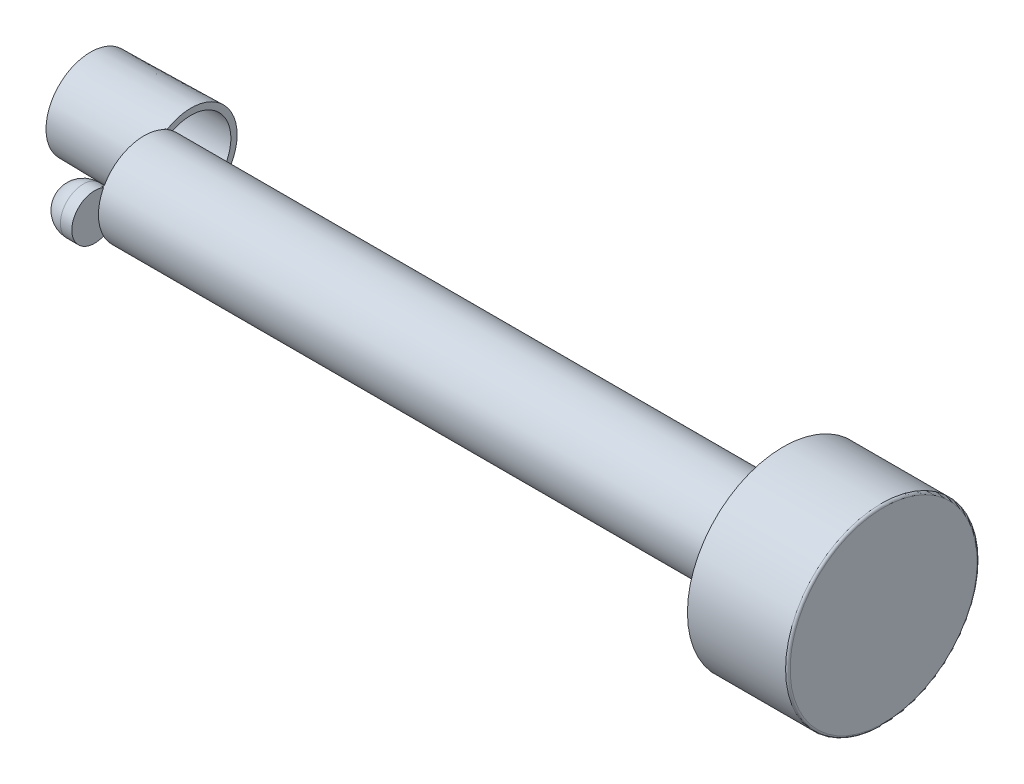
ISO-10303-21;
HEADER;
FILE_DESCRIPTION(('STEP AP214'),'2;1');
FILE_NAME('part.step','',(''),(''),'','','');
FILE_SCHEMA(('AUTOMOTIVE_DESIGN { 1 0 10303 214 1 1 1 1 }'));
ENDSEC;
DATA;
#1=APPLICATION_CONTEXT('core data for automotive mechanical design processes');
#2=APPLICATION_PROTOCOL_DEFINITION('international standard','automotive_design',2000,#1);
#3=PRODUCT_CONTEXT('',#1,'mechanical');
#4=PRODUCT('Part','Part','',(#3));
#5=PRODUCT_RELATED_PRODUCT_CATEGORY('part','',(#4));
#6=PRODUCT_DEFINITION_FORMATION('','',#4);
#7=PRODUCT_DEFINITION_CONTEXT('part definition',#1,'design');
#8=PRODUCT_DEFINITION('design','',#6,#7);
#9=PRODUCT_DEFINITION_SHAPE('','',#8);
#10=(LENGTH_UNIT() NAMED_UNIT(*) SI_UNIT(.MILLI.,.METRE.));
#11=(NAMED_UNIT(*) PLANE_ANGLE_UNIT() SI_UNIT($,.RADIAN.));
#12=(NAMED_UNIT(*) SI_UNIT($,.STERADIAN.) SOLID_ANGLE_UNIT());
#13=UNCERTAINTY_MEASURE_WITH_UNIT(LENGTH_MEASURE(1.E-05),#10,'distance_accuracy_value','');
#14=(GEOMETRIC_REPRESENTATION_CONTEXT(3) GLOBAL_UNCERTAINTY_ASSIGNED_CONTEXT((#13)) GLOBAL_UNIT_ASSIGNED_CONTEXT((#10,
#11,#12)) REPRESENTATION_CONTEXT('',''));
#15=CARTESIAN_POINT('',(0.,0.,0.));
#16=DIRECTION('',(0.,0.,1.));
#17=DIRECTION('',(1.,0.,0.));
#18=AXIS2_PLACEMENT_3D('',#15,#16,#17);
#19=CARTESIAN_POINT('',(0.,0.,0.));
#20=DIRECTION('',(1.,0.,0.));
#21=DIRECTION('',(0.,0.,-1.));
#22=AXIS2_PLACEMENT_3D('',#19,#20,#21);
#23=PLANE('',#22);
#24=CARTESIAN_POINT('',(0.,0.,0.));
#25=DIRECTION('',(1.,0.,0.));
#26=DIRECTION('',(0.,0.,-1.));
#27=AXIS2_PLACEMENT_3D('',#24,#25,#26);
#28=CIRCLE('',#27,4.);
#29=CARTESIAN_POINT('',(0.,-3.1166265568057,-2.50731707317073));
#30=VERTEX_POINT('',#29);
#31=CARTESIAN_POINT('',(0.,3.1166265568057,-2.50731707317073));
#32=VERTEX_POINT('',#31);
#33=EDGE_CURVE('E114',#30,#32,#28,.T.);
#34=ORIENTED_EDGE('',*,*,#33,.F.);
#35=CARTESIAN_POINT('',(0.,0.,-4.1));
#36=DIRECTION('',(-1.,0.,0.));
#37=DIRECTION('',(0.,0.,1.));
#38=AXIS2_PLACEMENT_3D('',#35,#36,#37);
#39=CIRCLE('',#38,3.5);
#40=EDGE_CURVE('E121',#30,#32,#39,.T.);
#41=ORIENTED_EDGE('',*,*,#40,.T.);
#42=EDGE_LOOP('',(#34,#41));
#43=FACE_BOUND('',#42,.T.);
#44=ADVANCED_FACE('F33',(#43),#23,.F.);
#45=CARTESIAN_POINT('',(1.,0.,0.));
#46=DIRECTION('',(-1.,0.,0.));
#47=DIRECTION('',(0.,0.,1.));
#48=AXIS2_PLACEMENT_3D('',#45,#46,#47);
#49=CYLINDRICAL_SURFACE('',#48,4.);
#50=CARTESIAN_POINT('',(0.,3.4635733898474,-2.00091463414634));
#51=VERTEX_POINT('',#50);
#52=EDGE_CURVE('E135',#32,#51,#28,.T.);
#53=ORIENTED_EDGE('',*,*,#52,.T.);
#54=CARTESIAN_POINT('',(-0.196509518712543,3.46161460532734,-2.00430145541606));
#55=CARTESIAN_POINT('',(-0.163757930433236,3.46194129952575,-2.00373722430909));
#56=CARTESIAN_POINT('',(-0.131006343067538,3.46226787866832,-2.00317287364976));
#57=CARTESIAN_POINT('',(-0.0655031701633607,3.46292080684177,-2.00204393322638));
#58=CARTESIAN_POINT('',(-0.0327515846248809,3.46324715587265,-2.00147934346233));
#59=CARTESIAN_POINT('',(0.,3.46357338984769,-2.00091463414592));
#60=B_SPLINE_CURVE_WITH_KNOTS('',3,(#54,#55,#56,#57,#58,#59),.UNSPECIFIED.,.F.,.F.,(4,2,4),(0.,
0.0982742315420674,0.196548463084135),.UNSPECIFIED.);
#61=CARTESIAN_POINT('',(-0.196509518712543,3.46161460532734,-2.00430145541606));
#62=VERTEX_POINT('',#61);
#63=EDGE_CURVE('E173',#62,#51,#60,.T.);
#64=ORIENTED_EDGE('',*,*,#63,.F.);
#65=CARTESIAN_POINT('',(-0.196509518712543,3.46161460532734,-2.00430145541606));
#66=CARTESIAN_POINT('',(-0.186228413976424,3.46170890980057,-2.00413635354212));
#67=CARTESIAN_POINT('',(-0.175977058727814,3.46227208304456,-2.00316591494196));
#68=CARTESIAN_POINT('',(-0.155858499034461,3.46426383597185,-1.99972056421048));
#69=CARTESIAN_POINT('',(-0.14598990241535,3.4656888884805,-1.99725178378498));
#70=CARTESIAN_POINT('',(-0.126880843730687,3.46933252468751,-1.99091546448274));
#71=CARTESIAN_POINT('',(-0.117639894229995,3.47155048402618,-1.98704902613902));
#72=CARTESIAN_POINT('',(-0.0999848206849864,3.47667213872164,-1.97807422393648));
#73=CARTESIAN_POINT('',(-0.091571339244297,3.47957636116068,-1.97296490539812));
#74=CARTESIAN_POINT('',(-0.0753474839671066,3.48610493411844,-1.96140723938538));
#75=CARTESIAN_POINT('',(-0.067586484024916,3.48975748182476,-1.95490577031648));
#76=CARTESIAN_POINT('',(-0.0532673461235203,3.49754244618214,-1.94094326630355));
#77=CARTESIAN_POINT('',(-0.0467094498074463,3.50167495896248,-1.93348203910309));
#78=CARTESIAN_POINT('',(-0.0341593344331263,3.51079864833767,-1.91687053747935));
#79=CARTESIAN_POINT('',(-0.0283254110505752,3.51583359321851,-1.90762485363682));
#80=CARTESIAN_POINT('',(-0.0182755696739683,3.52618179136174,-1.88842827088881));
#81=CARTESIAN_POINT('',(-0.0140614119060524,3.5314953403044,-1.8784766186242));
#82=CARTESIAN_POINT('',(-0.00709580656185521,3.5425240194525,-1.85759756736367));
#83=CARTESIAN_POINT('',(-0.00442733990265859,3.54824599169842,-1.84664625438155));
#84=CARTESIAN_POINT('',(-0.00088098036703332,3.55969014669868,-1.82449033188031));
#85=CARTESIAN_POINT('',(1.20114942700425E-06,3.56541229588589,-1.81328639449385));
#86=CARTESIAN_POINT('',(0.,3.57107477707088,-1.80206130211161));
#87=B_SPLINE_CURVE_WITH_KNOTS('',3,(#65,#66,#67,#68,#69,#70,#71,#72,#73,#74,#75,#76,#77,#78,#79,
#80,#81,#82,#83,#84,#85,#86),.UNSPECIFIED.,.F.,.F.,(4,2,2,2,2,2,2,2,2,2,4),(0.,
0.0307902288591626,0.0614552957399035,0.0920962689801449,0.122760852858493,0.154919844712333,
0.187085288638908,0.223049809332817,0.259053303505371,0.296843776707732,0.334543411767175),.UNSPECIFIED.);
#88=CARTESIAN_POINT('',(0.,3.57107477707088,-1.80206130211161));
#89=VERTEX_POINT('',#88);
#90=EDGE_CURVE('E46',#62,#89,#87,.T.);
#91=ORIENTED_EDGE('',*,*,#90,.T.);
#92=CARTESIAN_POINT('',(0.,2.01603826872064,3.45479228016011));
#93=VERTEX_POINT('',#92);
#94=EDGE_CURVE('E111',#89,#93,#28,.T.);
#95=ORIENTED_EDGE('',*,*,#94,.T.);
#96=CARTESIAN_POINT('',(0.,2.01603826872064,3.45479228016011));
#97=CARTESIAN_POINT('',(9.49307193796602E-06,2.00624438563196,3.46050963885048));
#98=CARTESIAN_POINT('',(-0.000951005305651288,1.99642591984421,3.46618125477343));
#99=CARTESIAN_POINT('',(-0.00474768782230124,1.97702474123825,3.47728256733756));
#100=CARTESIAN_POINT('',(-0.00758281998979137,1.9674418993234,3.48271239783638));
#101=CARTESIAN_POINT('',(-0.0150669368735395,1.94877946214422,3.49318971224865));
#102=CARTESIAN_POINT('',(-0.0197170513179024,1.93970018434914,3.4982369556811));
#103=CARTESIAN_POINT('',(-0.0306995682128399,1.92232408775959,3.50781532235016));
#104=CARTESIAN_POINT('',(-0.0370315347536729,1.91402706697029,3.51234657888833));
#105=CARTESIAN_POINT('',(-0.0511723963013751,1.89849659547287,3.52076534420059));
#106=CARTESIAN_POINT('',(-0.0589751206692201,1.89125891787573,3.52465541965818));
#107=CARTESIAN_POINT('',(-0.0758561148090955,1.87802603759496,3.53172402907698));
#108=CARTESIAN_POINT('',(-0.0849346357789641,1.87203108017332,3.53490242259127));
#109=CARTESIAN_POINT('',(-0.104068021247834,1.86149135103254,3.54046401704401));
#110=CARTESIAN_POINT('',(-0.114118905219684,1.85694096828244,3.54285029641067));
#111=CARTESIAN_POINT('',(-0.134939735078802,1.84940016911909,3.54679252782362));
#112=CARTESIAN_POINT('',(-0.145709227074704,1.84640877833267,3.54834899851603));
#113=CARTESIAN_POINT('',(-0.163789672643096,1.84283794205747,3.55020433266981));
#114=CARTESIAN_POINT('',(-0.170985127423814,1.8417802473485,3.55075296262703));
#115=CARTESIAN_POINT('',(-0.185452698724941,1.8403690878274,3.55148445086093));
#116=CARTESIAN_POINT('',(-0.192724690639011,1.84001461621119,3.55166783206553));
#117=CARTESIAN_POINT('',(-0.200000000000245,1.84001549171848,3.55166763510375));
#118=B_SPLINE_CURVE_WITH_KNOTS('',3,(#96,#97,#98,#99,#100,#101,#102,#103,#104,#105,#106,#107,
#108,#109,#110,#111,#112,#113,#114,#115,#116,#117),.UNSPECIFIED.,.F.,.F.,(4,2,2,2,2,2,2,2,2,2,
4),(0.,0.0339784265399295,0.0679378018722003,0.101918348871641,0.135890097224661,
0.169722366052867,0.203561305639758,0.237267152251013,0.270951907298916,0.292791721269298,
0.314600244561022),.UNSPECIFIED.);
#119=CARTESIAN_POINT('',(-0.2,1.84001549171707,3.55166763510343));
#120=VERTEX_POINT('',#119);
#121=EDGE_CURVE('E183',#93,#120,#118,.T.);
#122=ORIENTED_EDGE('',*,*,#121,.T.);
#123=DIRECTION('',(1.,0.,0.));
#124=VECTOR('',#123,1.);
#125=CARTESIAN_POINT('',(0.,1.84001549171707,3.55166763510343));
#126=LINE('',#125,#124);
#127=CARTESIAN_POINT('',(0.,1.84001549171707,3.55166763510343));
#128=VERTEX_POINT('',#127);
#129=EDGE_CURVE('E59',#128,#120,#126,.F.);
#130=ORIENTED_EDGE('',*,*,#129,.F.);
#131=CARTESIAN_POINT('',(0.,-1.84001549171707,3.55166763510343));
#132=VERTEX_POINT('',#131);
#133=EDGE_CURVE('E106',#128,#132,#28,.T.);
#134=ORIENTED_EDGE('',*,*,#133,.T.);
#135=DIRECTION('',(1.,0.,0.));
#136=VECTOR('',#135,1.);
#137=CARTESIAN_POINT('',(-0.2,-1.84001549171707,3.55166763510343));
#138=LINE('',#137,#136);
#139=CARTESIAN_POINT('',(-0.2,-1.84001549171707,3.55166763510343));
#140=VERTEX_POINT('',#139);
#141=EDGE_CURVE('E97',#140,#132,#138,.T.);
#142=ORIENTED_EDGE('',*,*,#141,.F.);
#143=CARTESIAN_POINT('',(-0.2,-1.84001549171707,3.55166763510343));
#144=CARTESIAN_POINT('',(-0.188775567708883,-1.84000632918303,3.5516708668143));
#145=CARTESIAN_POINT('',(-0.177554079053319,-1.84085634903461,3.55123198716677));
#146=CARTESIAN_POINT('',(-0.155437874670008,-1.84420706995971,3.54949386383636));
#147=CARTESIAN_POINT('',(-0.144542893922371,-1.84670639218398,3.54819533883102));
#148=CARTESIAN_POINT('',(-0.123375855772317,-1.85328978135263,3.54476090768498));
#149=CARTESIAN_POINT('',(-0.113104092246463,-1.85737458931558,3.54262460998428));
#150=CARTESIAN_POINT('',(-0.0934810360737707,-1.8669999233081,3.53756143927729));
#151=CARTESIAN_POINT('',(-0.0841295919611501,-1.87254020924312,3.53463469665997));
#152=CARTESIAN_POINT('',(-0.0666023881086761,-1.88491316665724,3.52805205327164));
#153=CARTESIAN_POINT('',(-0.0584275003199356,-1.89174678803873,3.52439561646171));
#154=CARTESIAN_POINT('',(-0.0434889751127516,-1.90649831451892,3.51643772490171));
#155=CARTESIAN_POINT('',(-0.036725598373969,-1.914416419455,3.5121361512586));
#156=CARTESIAN_POINT('',(-0.0247825512468713,-1.93112123702236,3.50297896773827));
#157=CARTESIAN_POINT('',(-0.0196072778522562,-1.93991027368614,3.49812186985065));
#158=CARTESIAN_POINT('',(-0.0110078974046918,-1.95807849926832,3.48798459416151));
#159=CARTESIAN_POINT('',(-0.00758294395250916,-1.967457400478,3.48270462228));
#160=CARTESIAN_POINT('',(-0.00338933206266107,-1.98341546132085,3.47363179260552));
#161=CARTESIAN_POINT('',(-0.00211872494404291,-1.98991068750471,3.46991520921776));
#162=CARTESIAN_POINT('',(-0.000424156854156729,-2.00295291410741,3.46240332481476));
#163=CARTESIAN_POINT('',(1.04129912460666E-06,-2.00949982477271,3.45860814705201));
#164=CARTESIAN_POINT('',(1.00765429915983E-12,-2.01603826872046,3.45479228016027));
#165=B_SPLINE_CURVE_WITH_KNOTS('',3,(#143,#144,#145,#146,#147,#148,#149,#150,#151,#152,#153,
#154,#155,#156,#157,#158,#159,#160,#161,#162,#163,#164),.UNSPECIFIED.,.F.,.F.,(4,2,2,2,2,2,2,2,
2,2,4),(0.,0.0336283682487797,0.0672286580766538,0.100844670832817,0.134455141795094,
0.168090394759991,0.201731854040098,0.235465633338153,0.269183084577829,0.291909693341325,
0.314603019151342),.UNSPECIFIED.);
#166=CARTESIAN_POINT('',(0.,-2.01603826872064,3.45479228016011));
#167=VERTEX_POINT('',#166);
#168=EDGE_CURVE('E178',#140,#167,#165,.T.);
#169=ORIENTED_EDGE('',*,*,#168,.T.);
#170=CARTESIAN_POINT('',(0.,-3.57107477707088,-1.80206130211161));
#171=VERTEX_POINT('',#170);
#172=EDGE_CURVE('E112',#167,#171,#28,.T.);
#173=ORIENTED_EDGE('',*,*,#172,.T.);
#174=CARTESIAN_POINT('',(0.,-3.57107477707088,-1.80206130211161));
#175=CARTESIAN_POINT('',(8.25288774161548E-06,-3.56341210447424,-1.81726018618969));
#176=CARTESIAN_POINT('',(-0.00161522542768494,-3.55562491057541,-1.83243694789484));
#177=CARTESIAN_POINT('',(-0.00815460849651412,-3.54011329532851,-1.86222124343084));
#178=CARTESIAN_POINT('',(-0.0130916040286348,-3.53238959895128,-1.87682449254198));
#179=CARTESIAN_POINT('',(-0.0253383764586932,-3.51850091594059,-1.90271872572988));
#180=CARTESIAN_POINT('',(-0.0322046986531956,-3.51227152869539,-1.91418400378387));
#181=CARTESIAN_POINT('',(-0.0482956424143895,-3.50047337678014,-1.93567429213193));
#182=CARTESIAN_POINT('',(-0.0575127219552882,-3.49490258125452,-1.94570375127717));
#183=CARTESIAN_POINT('',(-0.0768998896124404,-3.48534741073249,-1.9627628741259));
#184=CARTESIAN_POINT('',(-0.0868260743885053,-3.48125314202644,-1.97000748091226));
#185=CARTESIAN_POINT('',(-0.10811898934221,-3.47407411973142,-1.98264007477368));
#186=CARTESIAN_POINT('',(-0.119483745498682,-3.4709880031422,-1.98803056909585));
#187=CARTESIAN_POINT('',(-0.141649945935426,-3.46638502101654,-1.99604468379762));
#188=CARTESIAN_POINT('',(-0.152319496102444,-3.46471231126749,-1.99894401769115));
#189=CARTESIAN_POINT('',(-0.174147126869764,-3.46237506931144,-2.00298806441265));
#190=CARTESIAN_POINT('',(-0.185307419668214,-3.46171571747898,-2.00412376168114));
#191=CARTESIAN_POINT('',(-0.1965095187125,-3.46161460532745,-2.00430145541624));
#192=B_SPLINE_CURVE_WITH_KNOTS('',3,(#174,#175,#176,#177,#178,#179,#180,#181,#182,#183,#184,
#185,#186,#187,#188,#189,#190,#191),.UNSPECIFIED.,.F.,.F.,(4,2,2,2,2,2,2,2,4),(0.,
0.0510486867167465,0.10242542299057,0.146412025726984,0.190259241885509,0.228889025924215,
0.267466365062532,0.300823177353368,0.334349951974751),.UNSPECIFIED.);
#193=CARTESIAN_POINT('',(-0.196509518712543,-3.46161460532734,-2.00430145541606));
#194=VERTEX_POINT('',#193);
#195=EDGE_CURVE('E11',#171,#194,#192,.T.);
#196=ORIENTED_EDGE('',*,*,#195,.T.);
#197=CARTESIAN_POINT('',(0.,-3.4635733898474,-2.00091463414634));
#198=CARTESIAN_POINT('',(-0.0327515846248745,-3.46324715587244,-2.00147934346258));
#199=CARTESIAN_POINT('',(-0.0655031701633576,-3.46292080684165,-2.0020439332265));
#200=CARTESIAN_POINT('',(-0.131006343067541,-3.46226787866843,-2.00317287364965));
#201=CARTESIAN_POINT('',(-0.163757930433242,-3.461941299526,-2.0037372243089));
#202=CARTESIAN_POINT('',(-0.196509518712551,-3.46161460532774,-2.00430145541582));
#203=B_SPLINE_CURVE_WITH_KNOTS('',3,(#197,#198,#199,#200,#201,#202),.UNSPECIFIED.,.F.,.F.,(4,2,
4),(0.,0.0982742315420676,0.196548463084135),.UNSPECIFIED.);
#204=CARTESIAN_POINT('',(0.,-3.4635733898474,-2.00091463414634));
#205=VERTEX_POINT('',#204);
#206=EDGE_CURVE('E52',#205,#194,#203,.T.);
#207=ORIENTED_EDGE('',*,*,#206,.F.);
#208=EDGE_CURVE('E137',#205,#30,#28,.T.);
#209=ORIENTED_EDGE('',*,*,#208,.T.);
#210=ORIENTED_EDGE('',*,*,#33,.T.);
#211=EDGE_LOOP('',(#53,#64,#91,#95,#122,#130,#134,#142,#169,#173,#196,#207,#209,#210));
#212=FACE_BOUND('',#211,.T.);
#213=CARTESIAN_POINT('',(56.,0.,0.));
#214=DIRECTION('',(1.,0.,0.));
#215=DIRECTION('',(0.,0.,-1.));
#216=AXIS2_PLACEMENT_3D('',#213,#214,#215);
#217=CIRCLE('',#216,4.);
#218=CARTESIAN_POINT('',(56.,0.,-4.));
#219=VERTEX_POINT('',#218);
#220=EDGE_CURVE('E133',#219,#219,#217,.T.);
#221=ORIENTED_EDGE('',*,*,#220,.F.);
#222=EDGE_LOOP('',(#221));
#223=FACE_BOUND('',#222,.T.);
#224=ADVANCED_FACE('F108',(#212,#223),#49,.T.);
#225=ORIENTED_EDGE('',*,*,#172,.F.);
#226=CARTESIAN_POINT('',(0.,0.,4.33546798611203));
#227=DIRECTION('',(1.,0.,0.));
#228=DIRECTION('',(0.,0.,-1.));
#229=AXIS2_PLACEMENT_3D('',#226,#227,#228);
#230=CIRCLE('',#229,2.2);
#231=EDGE_CURVE('E150',#167,#93,#230,.T.);
#232=ORIENTED_EDGE('',*,*,#231,.T.);
#233=ORIENTED_EDGE('',*,*,#94,.F.);
#234=CARTESIAN_POINT('',(0.,0.,-4.1));
#235=DIRECTION('',(1.,0.,0.));
#236=DIRECTION('',(0.,0.,-1.));
#237=AXIS2_PLACEMENT_3D('',#234,#235,#236);
#238=CIRCLE('',#237,4.24653945262314);
#239=EDGE_CURVE('E104',#89,#171,#238,.T.);
#240=ORIENTED_EDGE('',*,*,#239,.T.);
#241=EDGE_LOOP('',(#225,#232,#233,#240));
#242=FACE_BOUND('',#241,.T.);
#243=ADVANCED_FACE('F206',(#242),#23,.F.);
#244=CARTESIAN_POINT('',(64.8,0.,0.));
#245=DIRECTION('',(-1.,0.,0.));
#246=DIRECTION('',(0.,0.,1.));
#247=AXIS2_PLACEMENT_3D('',#244,#245,#246);
#248=CYLINDRICAL_SURFACE('',#247,8.39);
#249=CARTESIAN_POINT('',(64.6,0.,0.));
#250=DIRECTION('',(1.,0.,0.));
#251=DIRECTION('',(0.,0.,-1.));
#252=AXIS2_PLACEMENT_3D('',#249,#250,#251);
#253=CIRCLE('',#252,8.39);
#254=CARTESIAN_POINT('',(64.6,0.,-8.39));
#255=VERTEX_POINT('',#254);
#256=EDGE_CURVE('E144',#255,#255,#253,.F.);
#257=ORIENTED_EDGE('',*,*,#256,.T.);
#258=EDGE_LOOP('',(#257));
#259=FACE_BOUND('',#258,.T.);
#260=CARTESIAN_POINT('',(56.,0.,0.));
#261=DIRECTION('',(1.,0.,0.));
#262=DIRECTION('',(0.,0.,-1.));
#263=AXIS2_PLACEMENT_3D('',#260,#261,#262);
#264=CIRCLE('',#263,8.39);
#265=CARTESIAN_POINT('',(56.,0.,-8.39));
#266=VERTEX_POINT('',#265);
#267=EDGE_CURVE('E128',#266,#266,#264,.T.);
#268=ORIENTED_EDGE('',*,*,#267,.T.);
#269=EDGE_LOOP('',(#268));
#270=FACE_BOUND('',#269,.T.);
#271=ADVANCED_FACE('F213',(#259,#270),#248,.T.);
#272=CARTESIAN_POINT('',(64.8,0.,0.));
#273=DIRECTION('',(1.,0.,0.));
#274=DIRECTION('',(0.,0.,-1.));
#275=AXIS2_PLACEMENT_3D('',#272,#273,#274);
#276=PLANE('',#275);
#277=CARTESIAN_POINT('',(64.8,0.,0.));
#278=DIRECTION('',(1.,0.,0.));
#279=DIRECTION('',(0.,0.,-1.));
#280=AXIS2_PLACEMENT_3D('',#277,#278,#279);
#281=CIRCLE('',#280,8.19);
#282=CARTESIAN_POINT('',(64.8,0.,-8.19));
#283=VERTEX_POINT('',#282);
#284=EDGE_CURVE('E141',#283,#283,#281,.T.);
#285=ORIENTED_EDGE('',*,*,#284,.T.);
#286=EDGE_LOOP('',(#285));
#287=FACE_BOUND('',#286,.T.);
#288=ADVANCED_FACE('F218',(#287),#276,.T.);
#289=CARTESIAN_POINT('',(56.,0.,0.));
#290=DIRECTION('',(1.,0.,0.));
#291=DIRECTION('',(0.,0.,-1.));
#292=AXIS2_PLACEMENT_3D('',#289,#290,#291);
#293=PLANE('',#292);
#294=ORIENTED_EDGE('',*,*,#220,.T.);
#295=EDGE_LOOP('',(#294));
#296=FACE_BOUND('',#295,.T.);
#297=ORIENTED_EDGE('',*,*,#267,.F.);
#298=EDGE_LOOP('',(#297));
#299=FACE_BOUND('',#298,.T.);
#300=ADVANCED_FACE('F254',(#296,#299),#293,.F.);
#301=CARTESIAN_POINT('',(-8.8,0.,-4.1));
#302=DIRECTION('',(-1.,0.,0.));
#303=DIRECTION('',(0.,0.,1.));
#304=AXIS2_PLACEMENT_3D('',#301,#302,#303);
#305=PLANE('',#304);
#306=CARTESIAN_POINT('',(-8.8,0.,-4.1));
#307=DIRECTION('',(-1.,0.,0.));
#308=DIRECTION('',(0.,0.,1.));
#309=AXIS2_PLACEMENT_3D('',#306,#307,#308);
#310=CIRCLE('',#309,3.89639542863168);
#311=CARTESIAN_POINT('',(-8.8,0.,-0.203604571368314));
#312=VERTEX_POINT('',#311);
#313=EDGE_CURVE('E125',#312,#312,#310,.T.);
#314=ORIENTED_EDGE('',*,*,#313,.T.);
#315=EDGE_LOOP('',(#314));
#316=FACE_BOUND('',#315,.T.);
#317=CARTESIAN_POINT('',(-8.8,0.,-4.1));
#318=DIRECTION('',(-1.,0.,0.));
#319=DIRECTION('',(0.,0.,1.));
#320=AXIS2_PLACEMENT_3D('',#317,#318,#319);
#321=CIRCLE('',#320,3.65360457136831);
#322=CARTESIAN_POINT('',(-8.8,0.,-0.446395428631684));
#323=VERTEX_POINT('',#322);
#324=EDGE_CURVE('E119',#323,#323,#321,.T.);
#325=ORIENTED_EDGE('',*,*,#324,.F.);
#326=EDGE_LOOP('',(#325));
#327=FACE_BOUND('',#326,.T.);
#328=ADVANCED_FACE('F252',(#316,#327),#305,.T.);
#329=CARTESIAN_POINT('',(0.,0.,-4.1));
#330=DIRECTION('',(-1.,0.,0.));
#331=DIRECTION('',(0.,0.,1.));
#332=AXIS2_PLACEMENT_3D('',#329,#330,#331);
#333=PLANE('',#332);
#334=ORIENTED_EDGE('',*,*,#52,.F.);
#335=EDGE_CURVE('E116',#32,#30,#39,.T.);
#336=ORIENTED_EDGE('',*,*,#335,.T.);
#337=ORIENTED_EDGE('',*,*,#208,.F.);
#338=CARTESIAN_POINT('',(0.,0.,-4.1));
#339=DIRECTION('',(-1.,0.,0.));
#340=DIRECTION('',(0.,0.,1.));
#341=AXIS2_PLACEMENT_3D('',#338,#339,#340);
#342=CIRCLE('',#341,4.05);
#343=EDGE_CURVE('E123',#51,#205,#342,.T.);
#344=ORIENTED_EDGE('',*,*,#343,.F.);
#345=EDGE_LOOP('',(#334,#336,#337,#344));
#346=FACE_BOUND('',#345,.T.);
#347=ADVANCED_FACE('F168',(#346),#333,.F.);
#348=CARTESIAN_POINT('',(0.,0.,-4.1));
#349=DIRECTION('',(1.,0.,0.));
#350=DIRECTION('',(0.,0.,1.));
#351=AXIS2_PLACEMENT_3D('',#348,#349,#350);
#352=CONICAL_SURFACE('',#351,4.05,0.0174532925199433);
#353=ORIENTED_EDGE('',*,*,#313,.F.);
#354=EDGE_LOOP('',(#353));
#355=FACE_BOUND('',#354,.T.);
#356=CARTESIAN_POINT('',(-0.196509518712543,0.,-4.1));
#357=DIRECTION('',(1.,0.,0.));
#358=DIRECTION('',(0.,0.,-1.));
#359=AXIS2_PLACEMENT_3D('',#356,#357,#358);
#360=CIRCLE('',#359,4.04656991359186);
#361=EDGE_CURVE('E157',#194,#62,#360,.F.);
#362=ORIENTED_EDGE('',*,*,#361,.T.);
#363=ORIENTED_EDGE('',*,*,#63,.T.);
#364=ORIENTED_EDGE('',*,*,#343,.T.);
#365=ORIENTED_EDGE('',*,*,#206,.T.);
#366=EDGE_LOOP('',(#362,#363,#364,#365));
#367=FACE_BOUND('',#366,.T.);
#368=ADVANCED_FACE('F162',(#355,#367),#352,.T.);
#369=CARTESIAN_POINT('',(0.,0.,-4.1));
#370=DIRECTION('',(-1.,0.,0.));
#371=DIRECTION('',(0.,0.,1.));
#372=AXIS2_PLACEMENT_3D('',#369,#370,#371);
#373=CONICAL_SURFACE('',#372,3.5,0.0174532925199433);
#374=ORIENTED_EDGE('',*,*,#324,.T.);
#375=EDGE_LOOP('',(#374));
#376=FACE_BOUND('',#375,.T.);
#377=ORIENTED_EDGE('',*,*,#335,.F.);
#378=ORIENTED_EDGE('',*,*,#40,.F.);
#379=EDGE_LOOP('',(#377,#378));
#380=FACE_BOUND('',#379,.T.);
#381=ADVANCED_FACE('F167',(#376,#380),#373,.F.);
#382=CARTESIAN_POINT('',(-3.,0.,4.33546798611203));
#383=DIRECTION('',(1.,0.,0.));
#384=DIRECTION('',(0.,0.,-1.));
#385=AXIS2_PLACEMENT_3D('',#382,#383,#384);
#386=CYLINDRICAL_SURFACE('',#385,2.);
#387=CARTESIAN_POINT('',(-1.,0.,4.33546798611203));
#388=DIRECTION('',(1.,0.,0.));
#389=DIRECTION('',(0.,0.,-1.));
#390=AXIS2_PLACEMENT_3D('',#387,#388,#389);
#391=CIRCLE('',#390,2.);
#392=CARTESIAN_POINT('',(-1.,0.,2.33546798611203));
#393=VERTEX_POINT('',#392);
#394=EDGE_CURVE('E138',#393,#393,#391,.T.);
#395=ORIENTED_EDGE('',*,*,#394,.T.);
#396=EDGE_LOOP('',(#395));
#397=FACE_BOUND('',#396,.T.);
#398=CARTESIAN_POINT('',(-0.2,0.,4.33546798611203));
#399=DIRECTION('',(1.,0.,0.));
#400=DIRECTION('',(0.,0.,-1.));
#401=AXIS2_PLACEMENT_3D('',#398,#399,#400);
#402=CIRCLE('',#401,2.);
#403=EDGE_CURVE('E103',#120,#140,#402,.F.);
#404=ORIENTED_EDGE('',*,*,#403,.T.);
#405=ORIENTED_EDGE('',*,*,#141,.T.);
#406=CARTESIAN_POINT('',(0.,0.,4.33546798611203));
#407=DIRECTION('',(-1.,0.,0.));
#408=DIRECTION('',(0.,0.,1.));
#409=AXIS2_PLACEMENT_3D('',#406,#407,#408);
#410=CIRCLE('',#409,2.);
#411=EDGE_CURVE('E100',#132,#128,#410,.T.);
#412=ORIENTED_EDGE('',*,*,#411,.T.);
#413=ORIENTED_EDGE('',*,*,#129,.T.);
#414=EDGE_LOOP('',(#404,#405,#412,#413));
#415=FACE_BOUND('',#414,.T.);
#416=ADVANCED_FACE('F98',(#397,#415),#386,.T.);
#417=CARTESIAN_POINT('',(0.,0.,4.33546798611203));
#418=DIRECTION('',(-1.,0.,0.));
#419=DIRECTION('',(0.,0.,1.));
#420=AXIS2_PLACEMENT_3D('',#417,#418,#419);
#421=PLANE('',#420);
#422=ORIENTED_EDGE('',*,*,#411,.F.);
#423=ORIENTED_EDGE('',*,*,#133,.F.);
#424=EDGE_LOOP('',(#422,#423));
#425=FACE_BOUND('',#424,.T.);
#426=ADVANCED_FACE('F115',(#425),#421,.F.);
#427=CARTESIAN_POINT('',(-1.,0.,4.33546798611203));
#428=DIRECTION('',(-1.,0.,0.));
#429=DIRECTION('',(0.,0.,1.));
#430=AXIS2_PLACEMENT_3D('',#427,#428,#429);
#431=SPHERICAL_SURFACE('',#430,2.);
#432=ORIENTED_EDGE('',*,*,#394,.F.);
#433=EDGE_LOOP('',(#432));
#434=FACE_BOUND('',#433,.T.);
#435=ADVANCED_FACE('F195',(#434),#431,.T.);
#436=CARTESIAN_POINT('',(64.6,0.,0.));
#437=DIRECTION('',(1.,0.,0.));
#438=DIRECTION('',(0.,0.,-1.));
#439=AXIS2_PLACEMENT_3D('',#436,#437,#438);
#440=TOROIDAL_SURFACE('',#439,8.19,0.2);
#441=ORIENTED_EDGE('',*,*,#256,.F.);
#442=EDGE_LOOP('',(#441));
#443=FACE_BOUND('',#442,.T.);
#444=ORIENTED_EDGE('',*,*,#284,.F.);
#445=EDGE_LOOP('',(#444));
#446=FACE_BOUND('',#445,.T.);
#447=ADVANCED_FACE('F191',(#443,#446),#440,.T.);
#448=CARTESIAN_POINT('',(-0.2,0.,4.33546798611203));
#449=DIRECTION('',(1.,0.,0.));
#450=DIRECTION('',(0.,0.,-1.));
#451=AXIS2_PLACEMENT_3D('',#448,#449,#450);
#452=TOROIDAL_SURFACE('',#451,2.2,0.2);
#453=ORIENTED_EDGE('',*,*,#121,.F.);
#454=ORIENTED_EDGE('',*,*,#231,.F.);
#455=ORIENTED_EDGE('',*,*,#168,.F.);
#456=ORIENTED_EDGE('',*,*,#403,.F.);
#457=EDGE_LOOP('',(#453,#454,#455,#456));
#458=FACE_BOUND('',#457,.T.);
#459=ADVANCED_FACE('F187',(#458),#452,.F.);
#460=CARTESIAN_POINT('',(-0.2,0.,-4.1));
#461=DIRECTION('',(1.,0.,0.));
#462=DIRECTION('',(0.,0.,-1.));
#463=AXIS2_PLACEMENT_3D('',#460,#461,#462);
#464=TOROIDAL_SURFACE('',#463,4.24653945262314,0.2);
#465=ORIENTED_EDGE('',*,*,#195,.F.);
#466=ORIENTED_EDGE('',*,*,#239,.F.);
#467=ORIENTED_EDGE('',*,*,#90,.F.);
#468=ORIENTED_EDGE('',*,*,#361,.F.);
#469=EDGE_LOOP('',(#465,#466,#467,#468));
#470=FACE_BOUND('',#469,.T.);
#471=ADVANCED_FACE('F35',(#470),#464,.F.);
#472=CLOSED_SHELL('',(#44,#224,#243,#271,#288,#300,#328,#347,#368,#381,#416,#426,#435,#447,#459,#471));
#473=MANIFOLD_SOLID_BREP('B2',#472);
#474=ADVANCED_BREP_SHAPE_REPRESENTATION('',(#18,#473),#14);
#475=SHAPE_DEFINITION_REPRESENTATION(#9,#474);
ENDSEC;
END-ISO-10303-21;
